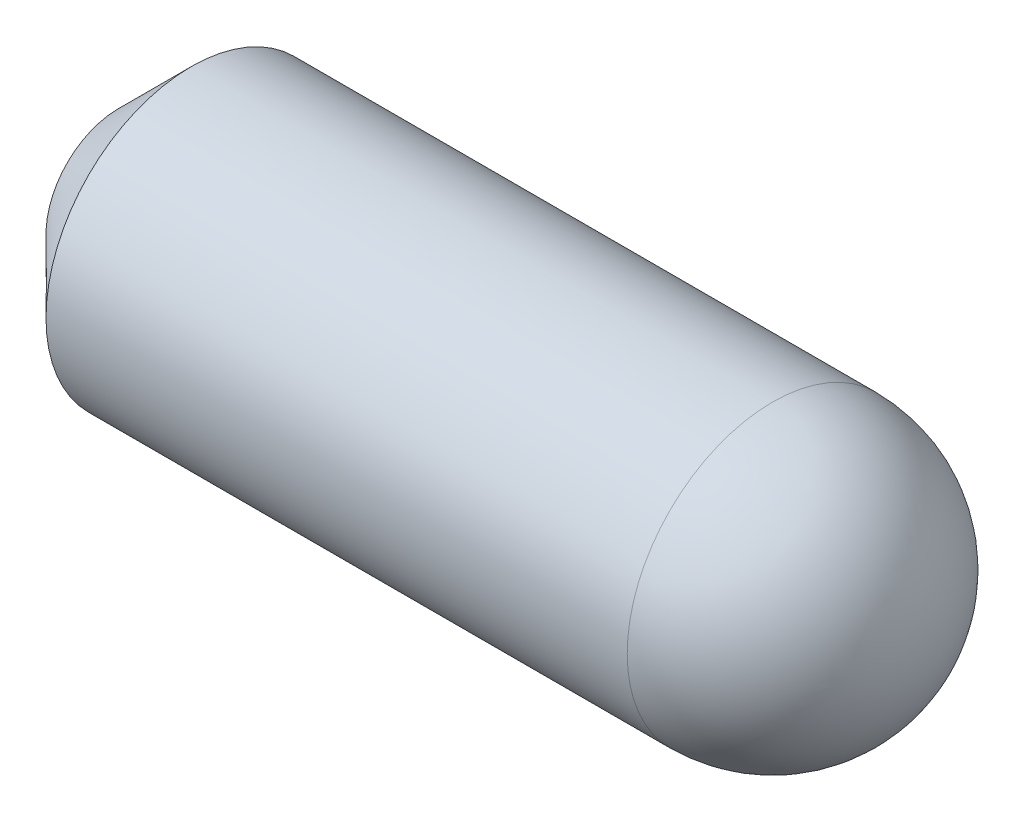
ISO-10303-21;
HEADER;
FILE_DESCRIPTION(('STEP AP214'),'2;1');
FILE_NAME('part.step','',(''),(''),'','','');
FILE_SCHEMA(('AUTOMOTIVE_DESIGN { 1 0 10303 214 1 1 1 1 }'));
ENDSEC;
DATA;
#1=APPLICATION_CONTEXT('core data for automotive mechanical design processes');
#2=APPLICATION_PROTOCOL_DEFINITION('international standard','automotive_design',2000,#1);
#3=PRODUCT_CONTEXT('',#1,'mechanical');
#4=PRODUCT('Part','Part','',(#3));
#5=PRODUCT_RELATED_PRODUCT_CATEGORY('part','',(#4));
#6=PRODUCT_DEFINITION_FORMATION('','',#4);
#7=PRODUCT_DEFINITION_CONTEXT('part definition',#1,'design');
#8=PRODUCT_DEFINITION('design','',#6,#7);
#9=PRODUCT_DEFINITION_SHAPE('','',#8);
#10=(LENGTH_UNIT() NAMED_UNIT(*) SI_UNIT(.MILLI.,.METRE.));
#11=(NAMED_UNIT(*) PLANE_ANGLE_UNIT() SI_UNIT($,.RADIAN.));
#12=(NAMED_UNIT(*) SI_UNIT($,.STERADIAN.) SOLID_ANGLE_UNIT());
#13=UNCERTAINTY_MEASURE_WITH_UNIT(LENGTH_MEASURE(1.E-05),#10,'distance_accuracy_value','');
#14=(GEOMETRIC_REPRESENTATION_CONTEXT(3) GLOBAL_UNCERTAINTY_ASSIGNED_CONTEXT((#13)) GLOBAL_UNIT_ASSIGNED_CONTEXT((#10,
#11,#12)) REPRESENTATION_CONTEXT('',''));
#15=CARTESIAN_POINT('',(0.,0.,0.));
#16=DIRECTION('',(0.,0.,1.));
#17=DIRECTION('',(1.,0.,0.));
#18=AXIS2_PLACEMENT_3D('',#15,#16,#17);
#19=CARTESIAN_POINT('',(0.,0.,0.));
#20=DIRECTION('',(1.,0.,0.));
#21=DIRECTION('',(0.,0.,-1.));
#22=AXIS2_PLACEMENT_3D('',#19,#20,#21);
#23=PLANE('',#22);
#24=CARTESIAN_POINT('',(0.,0.,0.));
#25=DIRECTION('',(1.,0.,0.));
#26=DIRECTION('',(0.,0.,-1.));
#27=AXIS2_PLACEMENT_3D('',#24,#25,#26);
#28=CIRCLE('',#27,1.);
#29=CARTESIAN_POINT('',(0.,0.,-1.));
#30=VERTEX_POINT('',#29);
#31=EDGE_CURVE('E46',#30,#30,#28,.F.);
#32=ORIENTED_EDGE('',*,*,#31,.T.);
#33=EDGE_LOOP('',(#32));
#34=FACE_BOUND('',#33,.T.);
#35=ADVANCED_FACE('F35',(#34),#23,.F.);
#36=CARTESIAN_POINT('',(-4.80150048085329,0.,0.));
#37=DIRECTION('',(-1.,0.,0.));
#38=DIRECTION('',(0.,0.,1.));
#39=AXIS2_PLACEMENT_3D('',#36,#37,#38);
#40=CYLINDRICAL_SURFACE('',#39,2.);
#41=CARTESIAN_POINT('',(9.,0.,0.));
#42=DIRECTION('',(-1.,0.,0.));
#43=DIRECTION('',(0.,0.,1.));
#44=AXIS2_PLACEMENT_3D('',#41,#42,#43);
#45=CIRCLE('',#44,2.);
#46=CARTESIAN_POINT('',(9.,0.,2.));
#47=VERTEX_POINT('',#46);
#48=EDGE_CURVE('E10',#47,#47,#45,.T.);
#49=ORIENTED_EDGE('',*,*,#48,.T.);
#50=EDGE_LOOP('',(#49));
#51=FACE_BOUND('',#50,.T.);
#52=CARTESIAN_POINT('',(1.,0.,0.));
#53=DIRECTION('',(1.,0.,0.));
#54=DIRECTION('',(0.,0.,-1.));
#55=AXIS2_PLACEMENT_3D('',#52,#53,#54);
#56=CIRCLE('',#55,2.);
#57=CARTESIAN_POINT('',(1.,0.,-2.));
#58=VERTEX_POINT('',#57);
#59=EDGE_CURVE('E42',#58,#58,#56,.T.);
#60=ORIENTED_EDGE('',*,*,#59,.T.);
#61=EDGE_LOOP('',(#60));
#62=FACE_BOUND('',#61,.T.);
#63=ADVANCED_FACE('F56',(#51,#62),#40,.T.);
#64=CARTESIAN_POINT('',(0.,0.,0.));
#65=DIRECTION('',(1.,0.,0.));
#66=DIRECTION('',(0.,0.,-1.));
#67=AXIS2_PLACEMENT_3D('',#64,#65,#66);
#68=CONICAL_SURFACE('',#67,1.,0.785398163397446);
#69=ORIENTED_EDGE('',*,*,#59,.F.);
#70=EDGE_LOOP('',(#69));
#71=FACE_BOUND('',#70,.T.);
#72=ORIENTED_EDGE('',*,*,#31,.F.);
#73=EDGE_LOOP('',(#72));
#74=FACE_BOUND('',#73,.T.);
#75=ADVANCED_FACE('F54',(#71,#74),#68,.T.);
#76=CARTESIAN_POINT('',(9.,0.,0.));
#77=DIRECTION('',(0.,0.,1.));
#78=DIRECTION('',(1.,0.,0.));
#79=AXIS2_PLACEMENT_3D('',#76,#77,#78);
#80=SPHERICAL_SURFACE('',#79,2.);
#81=CARTESIAN_POINT('',(9.,0.,0.));
#82=DIRECTION('',(-1.,0.,0.));
#83=DIRECTION('',(0.,0.,1.));
#84=AXIS2_PLACEMENT_3D('',#81,#82,#83);
#85=SPHERICAL_SURFACE('',#84,2.);
#86=ORIENTED_EDGE('',*,*,#48,.F.);
#87=EDGE_LOOP('',(#86));
#88=FACE_BOUND('',#87,.T.);
#89=ADVANCED_FACE('F37',(#88),#85,.T.);
#90=CLOSED_SHELL('',(#35,#63,#75,#89));
#91=MANIFOLD_SOLID_BREP('B2',#90);
#92=ADVANCED_BREP_SHAPE_REPRESENTATION('',(#18,#91),#14);
#93=SHAPE_DEFINITION_REPRESENTATION(#9,#92);
ENDSEC;
END-ISO-10303-21;
